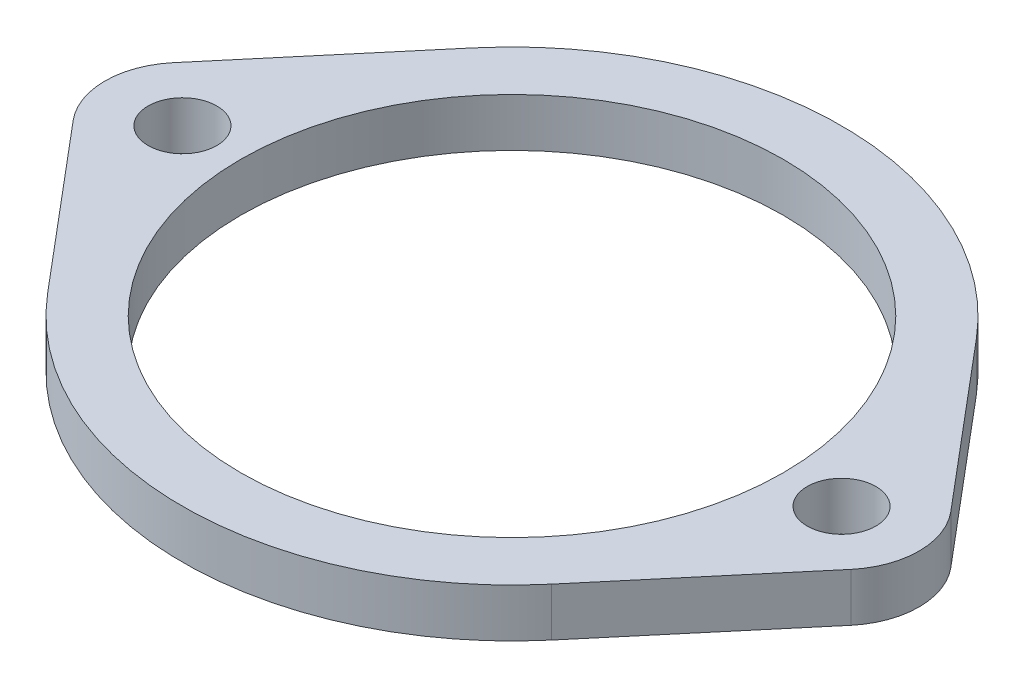
ISO-10303-21;
HEADER;
FILE_DESCRIPTION(('STEP AP214'),'2;1');
FILE_NAME('part.step','',(''),(''),'','','');
FILE_SCHEMA(('AUTOMOTIVE_DESIGN { 1 0 10303 214 1 1 1 1 }'));
ENDSEC;
DATA;
#1=APPLICATION_CONTEXT('core data for automotive mechanical design processes');
#2=APPLICATION_PROTOCOL_DEFINITION('international standard','automotive_design',2000,#1);
#3=PRODUCT_CONTEXT('',#1,'mechanical');
#4=PRODUCT('Part','Part','',(#3));
#5=PRODUCT_RELATED_PRODUCT_CATEGORY('part','',(#4));
#6=PRODUCT_DEFINITION_FORMATION('','',#4);
#7=PRODUCT_DEFINITION_CONTEXT('part definition',#1,'design');
#8=PRODUCT_DEFINITION('design','',#6,#7);
#9=PRODUCT_DEFINITION_SHAPE('','',#8);
#10=(LENGTH_UNIT() NAMED_UNIT(*) SI_UNIT(.MILLI.,.METRE.));
#11=(NAMED_UNIT(*) PLANE_ANGLE_UNIT() SI_UNIT($,.RADIAN.));
#12=(NAMED_UNIT(*) SI_UNIT($,.STERADIAN.) SOLID_ANGLE_UNIT());
#13=UNCERTAINTY_MEASURE_WITH_UNIT(LENGTH_MEASURE(1.E-05),#10,'distance_accuracy_value','');
#14=(GEOMETRIC_REPRESENTATION_CONTEXT(3) GLOBAL_UNCERTAINTY_ASSIGNED_CONTEXT((#13)) GLOBAL_UNIT_ASSIGNED_CONTEXT((#10,
#11,#12)) REPRESENTATION_CONTEXT('',''));
#15=CARTESIAN_POINT('',(0.,0.,0.));
#16=DIRECTION('',(0.,0.,1.));
#17=DIRECTION('',(1.,0.,0.));
#18=AXIS2_PLACEMENT_3D('',#15,#16,#17);
#19=CARTESIAN_POINT('',(21.4672463519048,3.175,18.0893770376289));
#20=DIRECTION('',(0.764705882352941,0.,0.644379479417843));
#21=DIRECTION('',(0.644379479417843,0.,-0.764705882352941));
#22=AXIS2_PLACEMENT_3D('',#19,#20,#21);
#23=PLANE('',#22);
#24=DIRECTION('',(-0.644379479417843,0.,0.764705882352941));
#25=VECTOR('',#24,1.);
#26=CARTESIAN_POINT('',(21.4672463519048,0.,18.0893770376289));
#27=LINE('',#26,#25);
#28=CARTESIAN_POINT('',(52.1447058823529,0.,-18.3165522445574));
#29=VERTEX_POINT('',#28);
#30=CARTESIAN_POINT('',(43.18,0.,-7.67784703936877));
#31=VERTEX_POINT('',#30);
#32=EDGE_CURVE('E150',#29,#31,#27,.T.);
#33=ORIENTED_EDGE('',*,*,#32,.F.);
#34=DIRECTION('',(0.,-1.,0.));
#35=VECTOR('',#34,1.);
#36=CARTESIAN_POINT('',(52.1447058823529,3.175,-18.3165522445574));
#37=LINE('',#36,#35);
#38=CARTESIAN_POINT('',(52.1447058823529,3.175,-18.3165522445574));
#39=VERTEX_POINT('',#38);
#40=EDGE_CURVE('E11',#39,#29,#37,.T.);
#41=ORIENTED_EDGE('',*,*,#40,.F.);
#42=DIRECTION('',(-0.644379479417843,0.,0.764705882352941));
#43=VECTOR('',#42,1.);
#44=CARTESIAN_POINT('',(21.4672463519048,3.175,18.0893770376289));
#45=LINE('',#44,#43);
#46=CARTESIAN_POINT('',(43.18,3.175,-7.67784703936877));
#47=VERTEX_POINT('',#46);
#48=EDGE_CURVE('E344',#39,#47,#45,.T.);
#49=ORIENTED_EDGE('',*,*,#48,.T.);
#50=DIRECTION('',(0.,-1.,0.));
#51=VECTOR('',#50,1.);
#52=CARTESIAN_POINT('',(43.18,3.175,-7.67784703936877));
#53=LINE('',#52,#51);
#54=EDGE_CURVE('E94',#47,#31,#53,.T.);
#55=ORIENTED_EDGE('',*,*,#54,.T.);
#56=EDGE_LOOP('',(#33,#41,#49,#55));
#57=FACE_BOUND('',#56,.T.);
#58=ADVANCED_FACE('F42',(#57),#23,.T.);
#59=CARTESIAN_POINT('',(48.26,3.175,-21.59));
#60=DIRECTION('',(0.,-1.,0.));
#61=DIRECTION('',(0.,0.,-1.));
#62=AXIS2_PLACEMENT_3D('',#59,#60,#61);
#63=CYLINDRICAL_SURFACE('',#62,5.08);
#64=CARTESIAN_POINT('',(48.26,0.,-21.59));
#65=DIRECTION('',(0.,1.,0.));
#66=DIRECTION('',(0.,0.,1.));
#67=AXIS2_PLACEMENT_3D('',#64,#65,#66);
#68=CIRCLE('',#67,5.08);
#69=CARTESIAN_POINT('',(52.1447058823529,0.,-24.8634477554426));
#70=VERTEX_POINT('',#69);
#71=EDGE_CURVE('E152',#29,#70,#68,.T.);
#72=ORIENTED_EDGE('',*,*,#71,.T.);
#73=DIRECTION('',(0.,-1.,0.));
#74=VECTOR('',#73,1.);
#75=CARTESIAN_POINT('',(52.1447058823529,3.175,-24.8634477554426));
#76=LINE('',#75,#74);
#77=CARTESIAN_POINT('',(52.1447058823529,3.175,-24.8634477554426));
#78=VERTEX_POINT('',#77);
#79=EDGE_CURVE('E51',#78,#70,#76,.T.);
#80=ORIENTED_EDGE('',*,*,#79,.F.);
#81=CARTESIAN_POINT('',(48.26,3.175,-21.59));
#82=DIRECTION('',(0.,1.,0.));
#83=DIRECTION('',(0.,0.,1.));
#84=AXIS2_PLACEMENT_3D('',#81,#82,#83);
#85=CIRCLE('',#84,5.08);
#86=EDGE_CURVE('E340',#39,#78,#85,.T.);
#87=ORIENTED_EDGE('',*,*,#86,.F.);
#88=ORIENTED_EDGE('',*,*,#40,.T.);
#89=EDGE_LOOP('',(#72,#80,#87,#88));
#90=FACE_BOUND('',#89,.T.);
#91=ADVANCED_FACE('F184',(#90),#63,.T.);
#92=CARTESIAN_POINT('',(42.744656762282,3.175,-36.0187888023348));
#93=DIRECTION('',(-0.764705882352941,0.,0.644379479417842));
#94=DIRECTION('',(0.644379479417842,0.,0.764705882352941));
#95=AXIS2_PLACEMENT_3D('',#92,#93,#94);
#96=PLANE('',#95);
#97=DIRECTION('',(-0.644379479417842,0.,-0.764705882352941));
#98=VECTOR('',#97,1.);
#99=CARTESIAN_POINT('',(42.744656762282,0.,-36.0187888023348));
#100=LINE('',#99,#98);
#101=CARTESIAN_POINT('',(43.18,0.,-35.5021529606312));
#102=VERTEX_POINT('',#101);
#103=EDGE_CURVE('E155',#70,#102,#100,.T.);
#104=ORIENTED_EDGE('',*,*,#103,.T.);
#105=DIRECTION('',(0.,-1.,0.));
#106=VECTOR('',#105,1.);
#107=CARTESIAN_POINT('',(43.18,3.175,-35.5021529606312));
#108=LINE('',#107,#106);
#109=CARTESIAN_POINT('',(43.18,3.175,-35.5021529606312));
#110=VERTEX_POINT('',#109);
#111=EDGE_CURVE('E174',#110,#102,#108,.T.);
#112=ORIENTED_EDGE('',*,*,#111,.F.);
#113=DIRECTION('',(-0.644379479417842,0.,-0.764705882352941));
#114=VECTOR('',#113,1.);
#115=CARTESIAN_POINT('',(42.744656762282,3.175,-36.0187888023348));
#116=LINE('',#115,#114);
#117=EDGE_CURVE('E180',#78,#110,#116,.T.);
#118=ORIENTED_EDGE('',*,*,#117,.F.);
#119=ORIENTED_EDGE('',*,*,#79,.T.);
#120=EDGE_LOOP('',(#104,#112,#118,#119));
#121=FACE_BOUND('',#120,.T.);
#122=ADVANCED_FACE('F178',(#121),#96,.F.);
#123=CARTESIAN_POINT('',(26.67,3.175,-21.59));
#124=DIRECTION('',(0.,-1.,0.));
#125=DIRECTION('',(0.,0.,-1.));
#126=AXIS2_PLACEMENT_3D('',#123,#124,#125);
#127=CYLINDRICAL_SURFACE('',#126,21.59);
#128=CARTESIAN_POINT('',(26.67,0.,-21.59));
#129=DIRECTION('',(0.,1.,0.));
#130=DIRECTION('',(0.,0.,1.));
#131=AXIS2_PLACEMENT_3D('',#128,#129,#130);
#132=CIRCLE('',#131,21.59);
#133=CARTESIAN_POINT('',(10.16,0.,-35.5021529606312));
#134=VERTEX_POINT('',#133);
#135=EDGE_CURVE('E158',#134,#102,#132,.F.);
#136=ORIENTED_EDGE('',*,*,#135,.F.);
#137=DIRECTION('',(0.,-1.,0.));
#138=VECTOR('',#137,1.);
#139=CARTESIAN_POINT('',(10.16,3.175,-35.5021529606312));
#140=LINE('',#139,#138);
#141=CARTESIAN_POINT('',(10.16,3.175,-35.5021529606312));
#142=VERTEX_POINT('',#141);
#143=EDGE_CURVE('E172',#142,#134,#140,.T.);
#144=ORIENTED_EDGE('',*,*,#143,.F.);
#145=CARTESIAN_POINT('',(26.67,3.175,-21.59));
#146=DIRECTION('',(0.,1.,0.));
#147=DIRECTION('',(0.,0.,1.));
#148=AXIS2_PLACEMENT_3D('',#145,#146,#147);
#149=CIRCLE('',#148,21.59);
#150=EDGE_CURVE('E136',#142,#110,#149,.F.);
#151=ORIENTED_EDGE('',*,*,#150,.T.);
#152=ORIENTED_EDGE('',*,*,#111,.T.);
#153=EDGE_LOOP('',(#136,#144,#151,#152));
#154=FACE_BOUND('',#153,.T.);
#155=ADVANCED_FACE('F234',(#154),#127,.T.);
#156=CARTESIAN_POINT('',(-11.5527536480952,3.175,-9.73492888363357));
#157=DIRECTION('',(-0.764705882352941,0.,-0.644379479417843));
#158=DIRECTION('',(-0.644379479417843,0.,0.764705882352941));
#159=AXIS2_PLACEMENT_3D('',#156,#157,#158);
#160=PLANE('',#159);
#161=DIRECTION('',(0.644379479417843,0.,-0.764705882352941));
#162=VECTOR('',#161,1.);
#163=CARTESIAN_POINT('',(-11.5527536480952,0.,-9.73492888363357));
#164=LINE('',#163,#162);
#165=CARTESIAN_POINT('',(1.19529411764706,0.,-24.8634477554426));
#166=VERTEX_POINT('',#165);
#167=EDGE_CURVE('E161',#166,#134,#164,.T.);
#168=ORIENTED_EDGE('',*,*,#167,.F.);
#169=DIRECTION('',(0.,-1.,0.));
#170=VECTOR('',#169,1.);
#171=CARTESIAN_POINT('',(1.19529411764706,3.175,-24.8634477554426));
#172=LINE('',#171,#170);
#173=CARTESIAN_POINT('',(1.19529411764706,3.175,-24.8634477554426));
#174=VERTEX_POINT('',#173);
#175=EDGE_CURVE('E123',#174,#166,#172,.T.);
#176=ORIENTED_EDGE('',*,*,#175,.F.);
#177=DIRECTION('',(0.644379479417843,0.,-0.764705882352941));
#178=VECTOR('',#177,1.);
#179=CARTESIAN_POINT('',(-11.5527536480952,3.175,-9.73492888363357));
#180=LINE('',#179,#178);
#181=EDGE_CURVE('E134',#174,#142,#180,.T.);
#182=ORIENTED_EDGE('',*,*,#181,.T.);
#183=ORIENTED_EDGE('',*,*,#143,.T.);
#184=EDGE_LOOP('',(#168,#176,#182,#183));
#185=FACE_BOUND('',#184,.T.);
#186=ADVANCED_FACE('F231',(#185),#160,.T.);
#187=CARTESIAN_POINT('',(5.08,3.175,-21.59));
#188=DIRECTION('',(0.,-1.,0.));
#189=DIRECTION('',(0.,0.,-1.));
#190=AXIS2_PLACEMENT_3D('',#187,#188,#189);
#191=CYLINDRICAL_SURFACE('',#190,5.08);
#192=CARTESIAN_POINT('',(5.08,0.,-21.59));
#193=DIRECTION('',(0.,1.,0.));
#194=DIRECTION('',(0.,0.,1.));
#195=AXIS2_PLACEMENT_3D('',#192,#193,#194);
#196=CIRCLE('',#195,5.08);
#197=CARTESIAN_POINT('',(1.19529411764706,0.,-18.3165522445574));
#198=VERTEX_POINT('',#197);
#199=EDGE_CURVE('E120',#198,#166,#196,.F.);
#200=ORIENTED_EDGE('',*,*,#199,.F.);
#201=DIRECTION('',(0.,-1.,0.));
#202=VECTOR('',#201,1.);
#203=CARTESIAN_POINT('',(1.19529411764706,3.175,-18.3165522445574));
#204=LINE('',#203,#202);
#205=CARTESIAN_POINT('',(1.19529411764706,3.175,-18.3165522445574));
#206=VERTEX_POINT('',#205);
#207=EDGE_CURVE('E114',#206,#198,#204,.T.);
#208=ORIENTED_EDGE('',*,*,#207,.F.);
#209=CARTESIAN_POINT('',(5.08,3.175,-21.59));
#210=DIRECTION('',(0.,1.,0.));
#211=DIRECTION('',(0.,0.,1.));
#212=AXIS2_PLACEMENT_3D('',#209,#210,#211);
#213=CIRCLE('',#212,5.08);
#214=EDGE_CURVE('E118',#206,#174,#213,.F.);
#215=ORIENTED_EDGE('',*,*,#214,.T.);
#216=ORIENTED_EDGE('',*,*,#175,.T.);
#217=EDGE_LOOP('',(#200,#208,#215,#216));
#218=FACE_BOUND('',#217,.T.);
#219=ADVANCED_FACE('F116',(#218),#191,.T.);
#220=CARTESIAN_POINT('',(9.724656762282,3.175,-8.19448288107233));
#221=DIRECTION('',(0.764705882352941,0.,-0.644379479417843));
#222=DIRECTION('',(-0.644379479417843,0.,-0.764705882352941));
#223=AXIS2_PLACEMENT_3D('',#220,#221,#222);
#224=PLANE('',#223);
#225=DIRECTION('',(0.644379479417843,0.,0.764705882352941));
#226=VECTOR('',#225,1.);
#227=CARTESIAN_POINT('',(9.724656762282,0.,-8.19448288107233));
#228=LINE('',#227,#226);
#229=CARTESIAN_POINT('',(10.16,0.,-7.67784703936878));
#230=VERTEX_POINT('',#229);
#231=EDGE_CURVE('E165',#198,#230,#228,.T.);
#232=ORIENTED_EDGE('',*,*,#231,.T.);
#233=DIRECTION('',(0.,-1.,0.));
#234=VECTOR('',#233,1.);
#235=CARTESIAN_POINT('',(10.16,3.175,-7.67784703936878));
#236=LINE('',#235,#234);
#237=CARTESIAN_POINT('',(10.16,3.175,-7.67784703936878));
#238=VERTEX_POINT('',#237);
#239=EDGE_CURVE('E124',#238,#230,#236,.T.);
#240=ORIENTED_EDGE('',*,*,#239,.F.);
#241=DIRECTION('',(0.644379479417843,0.,0.764705882352941));
#242=VECTOR('',#241,1.);
#243=CARTESIAN_POINT('',(9.724656762282,3.175,-8.19448288107233));
#244=LINE('',#243,#242);
#245=EDGE_CURVE('E127',#206,#238,#244,.T.);
#246=ORIENTED_EDGE('',*,*,#245,.F.);
#247=ORIENTED_EDGE('',*,*,#207,.T.);
#248=EDGE_LOOP('',(#232,#240,#246,#247));
#249=FACE_BOUND('',#248,.T.);
#250=ADVANCED_FACE('F128',(#249),#224,.F.);
#251=CARTESIAN_POINT('',(26.67,3.175,-21.59));
#252=DIRECTION('',(0.,-1.,0.));
#253=DIRECTION('',(0.,0.,-1.));
#254=AXIS2_PLACEMENT_3D('',#251,#252,#253);
#255=CYLINDRICAL_SURFACE('',#254,17.78);
#256=CARTESIAN_POINT('',(26.67,3.175,-21.59));
#257=DIRECTION('',(0.,1.,0.));
#258=DIRECTION('',(0.,0.,1.));
#259=AXIS2_PLACEMENT_3D('',#256,#257,#258);
#260=CIRCLE('',#259,17.78);
#261=CARTESIAN_POINT('',(26.67,3.175,-3.81));
#262=VERTEX_POINT('',#261);
#263=EDGE_CURVE('E346',#262,#262,#260,.T.);
#264=ORIENTED_EDGE('',*,*,#263,.T.);
#265=EDGE_LOOP('',(#264));
#266=FACE_BOUND('',#265,.T.);
#267=CARTESIAN_POINT('',(26.67,0.,-21.59));
#268=DIRECTION('',(0.,1.,0.));
#269=DIRECTION('',(0.,0.,1.));
#270=AXIS2_PLACEMENT_3D('',#267,#268,#269);
#271=CIRCLE('',#270,17.78);
#272=CARTESIAN_POINT('',(26.67,0.,-3.81));
#273=VERTEX_POINT('',#272);
#274=EDGE_CURVE('E147',#273,#273,#271,.T.);
#275=ORIENTED_EDGE('',*,*,#274,.F.);
#276=EDGE_LOOP('',(#275));
#277=FACE_BOUND('',#276,.T.);
#278=ADVANCED_FACE('F194',(#266,#277),#255,.F.);
#279=CARTESIAN_POINT('',(5.08,3.175,-21.59));
#280=DIRECTION('',(0.,-1.,0.));
#281=DIRECTION('',(0.,0.,-1.));
#282=AXIS2_PLACEMENT_3D('',#279,#280,#281);
#283=CYLINDRICAL_SURFACE('',#282,2.25);
#284=CARTESIAN_POINT('',(5.08,3.175,-21.59));
#285=DIRECTION('',(0.,1.,0.));
#286=DIRECTION('',(0.,0.,1.));
#287=AXIS2_PLACEMENT_3D('',#284,#285,#286);
#288=CIRCLE('',#287,2.25);
#289=CARTESIAN_POINT('',(5.08,3.175,-19.34));
#290=VERTEX_POINT('',#289);
#291=EDGE_CURVE('E208',#290,#290,#288,.T.);
#292=ORIENTED_EDGE('',*,*,#291,.T.);
#293=EDGE_LOOP('',(#292));
#294=FACE_BOUND('',#293,.T.);
#295=CARTESIAN_POINT('',(5.08,0.,-21.59));
#296=DIRECTION('',(0.,1.,0.));
#297=DIRECTION('',(0.,0.,1.));
#298=AXIS2_PLACEMENT_3D('',#295,#296,#297);
#299=CIRCLE('',#298,2.25);
#300=CARTESIAN_POINT('',(5.08,0.,-19.34));
#301=VERTEX_POINT('',#300);
#302=EDGE_CURVE('E144',#301,#301,#299,.T.);
#303=ORIENTED_EDGE('',*,*,#302,.F.);
#304=EDGE_LOOP('',(#303));
#305=FACE_BOUND('',#304,.T.);
#306=ADVANCED_FACE('F196',(#294,#305),#283,.F.);
#307=CARTESIAN_POINT('',(48.26,3.175,-21.59));
#308=DIRECTION('',(0.,-1.,0.));
#309=DIRECTION('',(0.,0.,-1.));
#310=AXIS2_PLACEMENT_3D('',#307,#308,#309);
#311=CYLINDRICAL_SURFACE('',#310,2.25);
#312=CARTESIAN_POINT('',(48.26,3.175,-21.59));
#313=DIRECTION('',(0.,1.,0.));
#314=DIRECTION('',(0.,0.,1.));
#315=AXIS2_PLACEMENT_3D('',#312,#313,#314);
#316=CIRCLE('',#315,2.25);
#317=CARTESIAN_POINT('',(48.26,3.175,-19.34));
#318=VERTEX_POINT('',#317);
#319=EDGE_CURVE('E168',#318,#318,#316,.F.);
#320=ORIENTED_EDGE('',*,*,#319,.F.);
#321=EDGE_LOOP('',(#320));
#322=FACE_BOUND('',#321,.T.);
#323=CARTESIAN_POINT('',(48.26,0.,-21.59));
#324=DIRECTION('',(0.,1.,0.));
#325=DIRECTION('',(0.,0.,1.));
#326=AXIS2_PLACEMENT_3D('',#323,#324,#325);
#327=CIRCLE('',#326,2.25);
#328=CARTESIAN_POINT('',(48.26,0.,-19.34));
#329=VERTEX_POINT('',#328);
#330=EDGE_CURVE('E141',#329,#329,#327,.F.);
#331=ORIENTED_EDGE('',*,*,#330,.T.);
#332=EDGE_LOOP('',(#331));
#333=FACE_BOUND('',#332,.T.);
#334=ADVANCED_FACE('F44',(#322,#333),#311,.F.);
#335=CARTESIAN_POINT('',(26.67,3.175,-21.59));
#336=DIRECTION('',(0.,-1.,0.));
#337=DIRECTION('',(0.,0.,-1.));
#338=AXIS2_PLACEMENT_3D('',#335,#336,#337);
#339=CYLINDRICAL_SURFACE('',#338,21.59);
#340=CARTESIAN_POINT('',(26.67,0.,-21.59));
#341=DIRECTION('',(0.,1.,0.));
#342=DIRECTION('',(0.,0.,1.));
#343=AXIS2_PLACEMENT_3D('',#340,#341,#342);
#344=CIRCLE('',#343,21.59);
#345=EDGE_CURVE('E87',#230,#31,#344,.T.);
#346=ORIENTED_EDGE('',*,*,#345,.T.);
#347=ORIENTED_EDGE('',*,*,#54,.F.);
#348=CARTESIAN_POINT('',(26.67,3.175,-21.59));
#349=DIRECTION('',(0.,1.,0.));
#350=DIRECTION('',(0.,0.,1.));
#351=AXIS2_PLACEMENT_3D('',#348,#349,#350);
#352=CIRCLE('',#351,21.59);
#353=EDGE_CURVE('E59',#238,#47,#352,.T.);
#354=ORIENTED_EDGE('',*,*,#353,.F.);
#355=ORIENTED_EDGE('',*,*,#239,.T.);
#356=EDGE_LOOP('',(#346,#347,#354,#355));
#357=FACE_BOUND('',#356,.T.);
#358=ADVANCED_FACE('F203',(#357),#339,.T.);
#359=CARTESIAN_POINT('',(0.,3.175,0.));
#360=DIRECTION('',(0.,1.,0.));
#361=DIRECTION('',(0.,0.,1.));
#362=AXIS2_PLACEMENT_3D('',#359,#360,#361);
#363=PLANE('',#362);
#364=ORIENTED_EDGE('',*,*,#319,.T.);
#365=EDGE_LOOP('',(#364));
#366=FACE_BOUND('',#365,.T.);
#367=ORIENTED_EDGE('',*,*,#291,.F.);
#368=EDGE_LOOP('',(#367));
#369=FACE_BOUND('',#368,.T.);
#370=ORIENTED_EDGE('',*,*,#263,.F.);
#371=EDGE_LOOP('',(#370));
#372=FACE_BOUND('',#371,.T.);
#373=ORIENTED_EDGE('',*,*,#48,.F.);
#374=ORIENTED_EDGE('',*,*,#86,.T.);
#375=ORIENTED_EDGE('',*,*,#117,.T.);
#376=ORIENTED_EDGE('',*,*,#150,.F.);
#377=ORIENTED_EDGE('',*,*,#181,.F.);
#378=ORIENTED_EDGE('',*,*,#214,.F.);
#379=ORIENTED_EDGE('',*,*,#245,.T.);
#380=ORIENTED_EDGE('',*,*,#353,.T.);
#381=EDGE_LOOP('',(#373,#374,#375,#376,#377,#378,#379,#380));
#382=FACE_BOUND('',#381,.T.);
#383=ADVANCED_FACE('F131',(#366,#369,#372,#382),#363,.T.);
#384=CARTESIAN_POINT('',(0.,0.,0.));
#385=DIRECTION('',(0.,1.,0.));
#386=DIRECTION('',(0.,0.,1.));
#387=AXIS2_PLACEMENT_3D('',#384,#385,#386);
#388=PLANE('',#387);
#389=ORIENTED_EDGE('',*,*,#330,.F.);
#390=EDGE_LOOP('',(#389));
#391=FACE_BOUND('',#390,.T.);
#392=ORIENTED_EDGE('',*,*,#302,.T.);
#393=EDGE_LOOP('',(#392));
#394=FACE_BOUND('',#393,.T.);
#395=ORIENTED_EDGE('',*,*,#274,.T.);
#396=EDGE_LOOP('',(#395));
#397=FACE_BOUND('',#396,.T.);
#398=ORIENTED_EDGE('',*,*,#32,.T.);
#399=ORIENTED_EDGE('',*,*,#345,.F.);
#400=ORIENTED_EDGE('',*,*,#231,.F.);
#401=ORIENTED_EDGE('',*,*,#199,.T.);
#402=ORIENTED_EDGE('',*,*,#167,.T.);
#403=ORIENTED_EDGE('',*,*,#135,.T.);
#404=ORIENTED_EDGE('',*,*,#103,.F.);
#405=ORIENTED_EDGE('',*,*,#71,.F.);
#406=EDGE_LOOP('',(#398,#399,#400,#401,#402,#403,#404,#405));
#407=FACE_BOUND('',#406,.T.);
#408=ADVANCED_FACE('F185',(#391,#394,#397,#407),#388,.F.);
#409=CLOSED_SHELL('',(#58,#91,#122,#155,#186,#219,#250,#278,#306,#334,#358,#383,#408));
#410=MANIFOLD_SOLID_BREP('B2',#409);
#411=ADVANCED_BREP_SHAPE_REPRESENTATION('',(#18,#410),#14);
#412=SHAPE_DEFINITION_REPRESENTATION(#9,#411);
ENDSEC;
END-ISO-10303-21;
